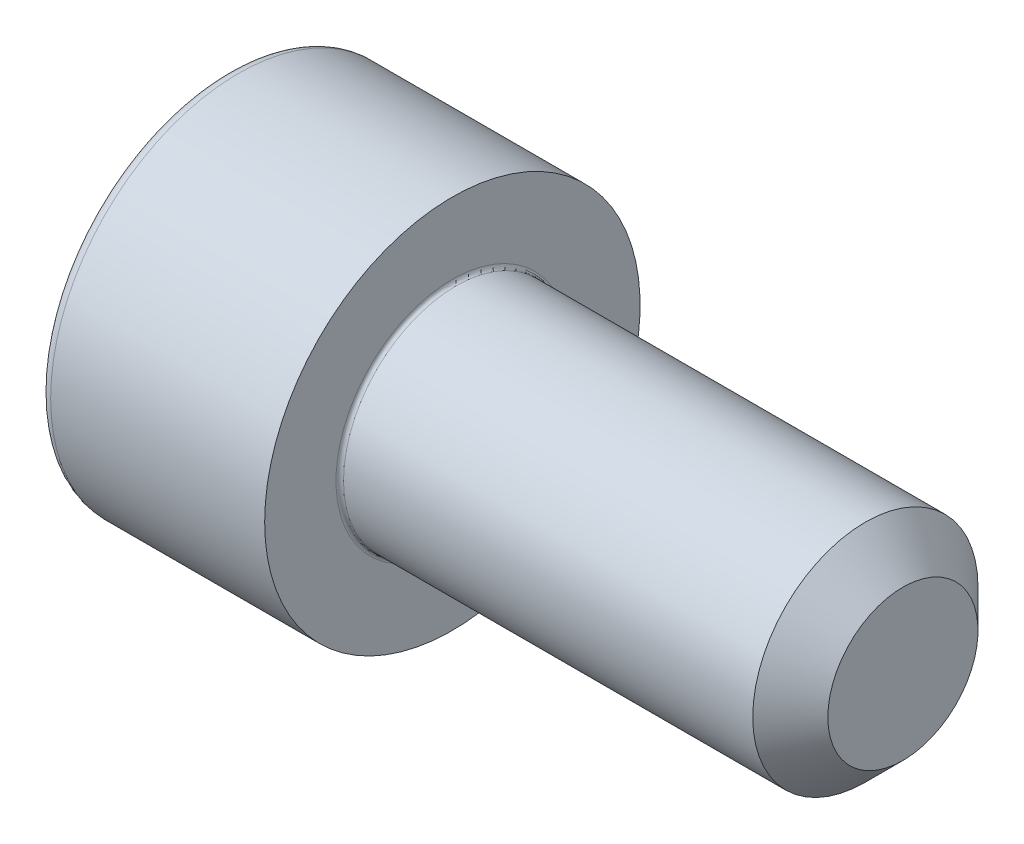
ISO-10303-21;
HEADER;
FILE_DESCRIPTION(('STEP AP214'),'2;1');
FILE_NAME('part.step','',(''),(''),'','','');
FILE_SCHEMA(('AUTOMOTIVE_DESIGN { 1 0 10303 214 1 1 1 1 }'));
ENDSEC;
DATA;
#1=APPLICATION_CONTEXT('core data for automotive mechanical design processes');
#2=APPLICATION_PROTOCOL_DEFINITION('international standard','automotive_design',2000,#1);
#3=PRODUCT_CONTEXT('',#1,'mechanical');
#4=PRODUCT('Part','Part','',(#3));
#5=PRODUCT_RELATED_PRODUCT_CATEGORY('part','',(#4));
#6=PRODUCT_DEFINITION_FORMATION('','',#4);
#7=PRODUCT_DEFINITION_CONTEXT('part definition',#1,'design');
#8=PRODUCT_DEFINITION('design','',#6,#7);
#9=PRODUCT_DEFINITION_SHAPE('','',#8);
#10=(LENGTH_UNIT() NAMED_UNIT(*) SI_UNIT(.MILLI.,.METRE.));
#11=(NAMED_UNIT(*) PLANE_ANGLE_UNIT() SI_UNIT($,.RADIAN.));
#12=(NAMED_UNIT(*) SI_UNIT($,.STERADIAN.) SOLID_ANGLE_UNIT());
#13=UNCERTAINTY_MEASURE_WITH_UNIT(LENGTH_MEASURE(1.E-05),#10,'distance_accuracy_value','');
#14=(GEOMETRIC_REPRESENTATION_CONTEXT(3) GLOBAL_UNCERTAINTY_ASSIGNED_CONTEXT((#13)) GLOBAL_UNIT_ASSIGNED_CONTEXT((#10,
#11,#12)) REPRESENTATION_CONTEXT('',''));
#15=CARTESIAN_POINT('',(0.,0.,0.));
#16=DIRECTION('',(0.,0.,1.));
#17=DIRECTION('',(1.,0.,0.));
#18=AXIS2_PLACEMENT_3D('',#15,#16,#17);
#19=CARTESIAN_POINT('',(0.,0.,0.));
#20=DIRECTION('',(-1.,0.,0.));
#21=DIRECTION('',(0.,0.,1.));
#22=AXIS2_PLACEMENT_3D('',#19,#20,#21);
#23=PLANE('',#22);
#24=DIRECTION('',(0.,-0.499999999999999,0.866025403784439));
#25=VECTOR('',#24,1.);
#26=CARTESIAN_POINT('',(0.,2.88675134594813,0.));
#27=LINE('',#26,#25);
#28=CARTESIAN_POINT('',(0.,2.88675134594813,0.));
#29=VERTEX_POINT('',#28);
#30=CARTESIAN_POINT('',(0.,1.44337567297406,2.5));
#31=VERTEX_POINT('',#30);
#32=EDGE_CURVE('E258',#29,#31,#27,.T.);
#33=ORIENTED_EDGE('',*,*,#32,.T.);
#34=DIRECTION('',(0.,1.,0.));
#35=VECTOR('',#34,1.);
#36=CARTESIAN_POINT('',(0.,-1.44337567297407,2.5));
#37=LINE('',#36,#35);
#38=CARTESIAN_POINT('',(0.,-1.44337567297407,2.5));
#39=VERTEX_POINT('',#38);
#40=EDGE_CURVE('E130',#39,#31,#37,.T.);
#41=ORIENTED_EDGE('',*,*,#40,.F.);
#42=DIRECTION('',(0.,-0.500000000000001,-0.866025403784438));
#43=VECTOR('',#42,1.);
#44=CARTESIAN_POINT('',(0.,-1.44337567297407,2.5));
#45=LINE('',#44,#43);
#46=CARTESIAN_POINT('',(0.,-2.88675134594814,0.));
#47=VERTEX_POINT('',#46);
#48=EDGE_CURVE('E261',#39,#47,#45,.T.);
#49=ORIENTED_EDGE('',*,*,#48,.T.);
#50=DIRECTION('',(0.,0.499999999999999,-0.866025403784439));
#51=VECTOR('',#50,1.);
#52=CARTESIAN_POINT('',(0.,-2.88675134594814,0.));
#53=LINE('',#52,#51);
#54=CARTESIAN_POINT('',(0.,-1.44337567297407,-2.5));
#55=VERTEX_POINT('',#54);
#56=EDGE_CURVE('E264',#47,#55,#53,.T.);
#57=ORIENTED_EDGE('',*,*,#56,.T.);
#58=DIRECTION('',(0.,-1.,0.));
#59=VECTOR('',#58,1.);
#60=CARTESIAN_POINT('',(0.,1.44337567297406,-2.5));
#61=LINE('',#60,#59);
#62=CARTESIAN_POINT('',(0.,1.44337567297406,-2.5));
#63=VERTEX_POINT('',#62);
#64=EDGE_CURVE('E267',#63,#55,#61,.T.);
#65=ORIENTED_EDGE('',*,*,#64,.F.);
#66=DIRECTION('',(0.,-0.500000000000001,-0.866025403784438));
#67=VECTOR('',#66,1.);
#68=CARTESIAN_POINT('',(0.,2.88675134594813,0.));
#69=LINE('',#68,#67);
#70=EDGE_CURVE('E125',#29,#63,#69,.T.);
#71=ORIENTED_EDGE('',*,*,#70,.F.);
#72=EDGE_LOOP('',(#33,#41,#49,#57,#65,#71));
#73=FACE_BOUND('',#72,.T.);
#74=CARTESIAN_POINT('',(0.,0.,0.));
#75=DIRECTION('',(-1.,0.,0.));
#76=DIRECTION('',(0.,0.,1.));
#77=AXIS2_PLACEMENT_3D('',#74,#75,#76);
#78=CIRCLE('',#77,4.7);
#79=CARTESIAN_POINT('',(0.,0.,4.7));
#80=VERTEX_POINT('',#79);
#81=EDGE_CURVE('E42',#80,#80,#78,.T.);
#82=ORIENTED_EDGE('',*,*,#81,.T.);
#83=EDGE_LOOP('',(#82));
#84=FACE_BOUND('',#83,.T.);
#85=ADVANCED_FACE('F34',(#73,#84),#23,.T.);
#86=CARTESIAN_POINT('',(-31.75,0.,0.));
#87=DIRECTION('',(-1.,0.,0.));
#88=DIRECTION('',(0.,0.,1.));
#89=AXIS2_PLACEMENT_3D('',#86,#87,#88);
#90=CYLINDRICAL_SURFACE('',#89,5.);
#91=CARTESIAN_POINT('',(0.300000000000002,0.,0.));
#92=DIRECTION('',(-1.,0.,0.));
#93=DIRECTION('',(0.,0.,1.));
#94=AXIS2_PLACEMENT_3D('',#91,#92,#93);
#95=CIRCLE('',#94,5.);
#96=CARTESIAN_POINT('',(0.300000000000002,0.,5.));
#97=VERTEX_POINT('',#96);
#98=EDGE_CURVE('E11',#97,#97,#95,.F.);
#99=ORIENTED_EDGE('',*,*,#98,.T.);
#100=EDGE_LOOP('',(#99));
#101=FACE_BOUND('',#100,.T.);
#102=CARTESIAN_POINT('',(6.,0.,0.));
#103=DIRECTION('',(-1.,0.,0.));
#104=DIRECTION('',(0.,0.,1.));
#105=AXIS2_PLACEMENT_3D('',#102,#103,#104);
#106=CIRCLE('',#105,5.);
#107=CARTESIAN_POINT('',(6.,0.,5.));
#108=VERTEX_POINT('',#107);
#109=EDGE_CURVE('E148',#108,#108,#106,.T.);
#110=ORIENTED_EDGE('',*,*,#109,.T.);
#111=EDGE_LOOP('',(#110));
#112=FACE_BOUND('',#111,.T.);
#113=ADVANCED_FACE('F172',(#101,#112),#90,.T.);
#114=CARTESIAN_POINT('',(6.,5.,0.));
#115=DIRECTION('',(1.,0.,0.));
#116=DIRECTION('',(0.,0.,-1.));
#117=AXIS2_PLACEMENT_3D('',#114,#115,#116);
#118=PLANE('',#117);
#119=CARTESIAN_POINT('',(6.,0.,0.));
#120=DIRECTION('',(1.,0.,0.));
#121=DIRECTION('',(0.,0.,-1.));
#122=AXIS2_PLACEMENT_3D('',#119,#120,#121);
#123=CIRCLE('',#122,3.09999999999999);
#124=CARTESIAN_POINT('',(6.,0.,-3.09999999999999));
#125=VERTEX_POINT('',#124);
#126=EDGE_CURVE('E151',#125,#125,#123,.F.);
#127=ORIENTED_EDGE('',*,*,#126,.T.);
#128=EDGE_LOOP('',(#127));
#129=FACE_BOUND('',#128,.T.);
#130=ORIENTED_EDGE('',*,*,#109,.F.);
#131=EDGE_LOOP('',(#130));
#132=FACE_BOUND('',#131,.T.);
#133=ADVANCED_FACE('F178',(#129,#132),#118,.T.);
#134=CARTESIAN_POINT('',(-31.75,0.,0.));
#135=DIRECTION('',(-1.,0.,0.));
#136=DIRECTION('',(0.,0.,1.));
#137=AXIS2_PLACEMENT_3D('',#134,#135,#136);
#138=CYLINDRICAL_SURFACE('',#137,2.99999999999999);
#139=CARTESIAN_POINT('',(6.1,0.,0.));
#140=DIRECTION('',(1.,0.,0.));
#141=DIRECTION('',(0.,0.,-1.));
#142=AXIS2_PLACEMENT_3D('',#139,#140,#141);
#143=CIRCLE('',#142,2.99999999999999);
#144=CARTESIAN_POINT('',(6.1,0.,-2.99999999999999));
#145=VERTEX_POINT('',#144);
#146=EDGE_CURVE('E154',#145,#145,#143,.T.);
#147=ORIENTED_EDGE('',*,*,#146,.T.);
#148=EDGE_LOOP('',(#147));
#149=FACE_BOUND('',#148,.T.);
#150=CARTESIAN_POINT('',(17.,0.,0.));
#151=DIRECTION('',(-1.,0.,0.));
#152=DIRECTION('',(0.,0.,1.));
#153=AXIS2_PLACEMENT_3D('',#150,#151,#152);
#154=CIRCLE('',#153,2.99999999999999);
#155=CARTESIAN_POINT('',(17.,0.,2.99999999999999));
#156=VERTEX_POINT('',#155);
#157=EDGE_CURVE('E145',#156,#156,#154,.T.);
#158=ORIENTED_EDGE('',*,*,#157,.T.);
#159=EDGE_LOOP('',(#158));
#160=FACE_BOUND('',#159,.T.);
#161=ADVANCED_FACE('F184',(#149,#160),#138,.T.);
#162=CARTESIAN_POINT('',(18.,0.,0.));
#163=DIRECTION('',(-1.,0.,0.));
#164=DIRECTION('',(0.,0.,1.));
#165=AXIS2_PLACEMENT_3D('',#162,#163,#164);
#166=CONICAL_SURFACE('',#165,2.,0.785398163397441);
#167=ORIENTED_EDGE('',*,*,#157,.F.);
#168=EDGE_LOOP('',(#167));
#169=FACE_BOUND('',#168,.T.);
#170=CARTESIAN_POINT('',(18.,0.,0.));
#171=DIRECTION('',(-1.,0.,0.));
#172=DIRECTION('',(0.,0.,1.));
#173=AXIS2_PLACEMENT_3D('',#170,#171,#172);
#174=CIRCLE('',#173,2.);
#175=CARTESIAN_POINT('',(18.,0.,2.));
#176=VERTEX_POINT('',#175);
#177=EDGE_CURVE('E141',#176,#176,#174,.T.);
#178=ORIENTED_EDGE('',*,*,#177,.T.);
#179=EDGE_LOOP('',(#178));
#180=FACE_BOUND('',#179,.T.);
#181=ADVANCED_FACE('F188',(#169,#180),#166,.T.);
#182=CARTESIAN_POINT('',(18.,2.,0.));
#183=DIRECTION('',(1.,0.,0.));
#184=DIRECTION('',(0.,0.,-1.));
#185=AXIS2_PLACEMENT_3D('',#182,#183,#184);
#186=PLANE('',#185);
#187=ORIENTED_EDGE('',*,*,#177,.F.);
#188=EDGE_LOOP('',(#187));
#189=FACE_BOUND('',#188,.T.);
#190=ADVANCED_FACE('F168',(#189),#186,.T.);
#191=CARTESIAN_POINT('',(6.1,0.,0.));
#192=DIRECTION('',(1.,0.,0.));
#193=DIRECTION('',(0.,0.,-1.));
#194=AXIS2_PLACEMENT_3D('',#191,#192,#193);
#195=TOROIDAL_SURFACE('',#194,3.09999999999999,0.1);
#196=ORIENTED_EDGE('',*,*,#146,.F.);
#197=EDGE_LOOP('',(#196));
#198=FACE_BOUND('',#197,.T.);
#199=ORIENTED_EDGE('',*,*,#126,.F.);
#200=EDGE_LOOP('',(#199));
#201=FACE_BOUND('',#200,.T.);
#202=ADVANCED_FACE('F161',(#198,#201),#195,.F.);
#203=CARTESIAN_POINT('',(0.300000000000002,0.,0.));
#204=DIRECTION('',(-1.,0.,0.));
#205=DIRECTION('',(0.,0.,1.));
#206=AXIS2_PLACEMENT_3D('',#203,#204,#205);
#207=TOROIDAL_SURFACE('',#206,4.7,0.3);
#208=ORIENTED_EDGE('',*,*,#98,.F.);
#209=EDGE_LOOP('',(#208));
#210=FACE_BOUND('',#209,.T.);
#211=ORIENTED_EDGE('',*,*,#81,.F.);
#212=EDGE_LOOP('',(#211));
#213=FACE_BOUND('',#212,.T.);
#214=ADVANCED_FACE('F36',(#210,#213),#207,.T.);
#215=CARTESIAN_POINT('',(1.3,2.88675134594813,0.));
#216=DIRECTION('',(0.,-0.866025403784439,-0.499999999999999));
#217=DIRECTION('',(0.,0.5,-0.866025403784439));
#218=AXIS2_PLACEMENT_3D('',#215,#216,#217);
#219=PLANE('',#218);
#220=ORIENTED_EDGE('',*,*,#32,.F.);
#221=DIRECTION('',(-1.,0.,0.));
#222=VECTOR('',#221,1.);
#223=CARTESIAN_POINT('',(1.3,2.88675134594813,0.));
#224=LINE('',#223,#222);
#225=CARTESIAN_POINT('',(1.3,2.88675134594813,0.));
#226=VERTEX_POINT('',#225);
#227=EDGE_CURVE('E248',#226,#29,#224,.T.);
#228=ORIENTED_EDGE('',*,*,#227,.F.);
#229=DIRECTION('',(0.,-0.499999999999999,0.866025403784439));
#230=VECTOR('',#229,1.);
#231=CARTESIAN_POINT('',(1.3,2.88675134594813,0.));
#232=LINE('',#231,#230);
#233=CARTESIAN_POINT('',(1.3,2.16506350946109,1.25));
#234=VERTEX_POINT('',#233);
#235=EDGE_CURVE('E117',#226,#234,#232,.T.);
#236=ORIENTED_EDGE('',*,*,#235,.T.);
#237=CARTESIAN_POINT('',(1.3,1.44337567297406,2.5));
#238=VERTEX_POINT('',#237);
#239=EDGE_CURVE('E108',#234,#238,#232,.T.);
#240=ORIENTED_EDGE('',*,*,#239,.T.);
#241=DIRECTION('',(-1.,0.,0.));
#242=VECTOR('',#241,1.);
#243=CARTESIAN_POINT('',(1.3,1.44337567297406,2.5));
#244=LINE('',#243,#242);
#245=EDGE_CURVE('E122',#238,#31,#244,.T.);
#246=ORIENTED_EDGE('',*,*,#245,.T.);
#247=EDGE_LOOP('',(#220,#228,#236,#240,#246));
#248=FACE_BOUND('',#247,.T.);
#249=ADVANCED_FACE('F121',(#248),#219,.T.);
#250=CARTESIAN_POINT('',(1.3,-1.44337567297407,2.5));
#251=DIRECTION('',(0.,0.,1.));
#252=DIRECTION('',(0.,-1.,0.));
#253=AXIS2_PLACEMENT_3D('',#250,#251,#252);
#254=PLANE('',#253);
#255=ORIENTED_EDGE('',*,*,#40,.T.);
#256=ORIENTED_EDGE('',*,*,#245,.F.);
#257=DIRECTION('',(0.,1.,0.));
#258=VECTOR('',#257,1.);
#259=CARTESIAN_POINT('',(1.3,-1.44337567297407,2.5));
#260=LINE('',#259,#258);
#261=CARTESIAN_POINT('',(1.3,0.,2.5));
#262=VERTEX_POINT('',#261);
#263=EDGE_CURVE('E105',#262,#238,#260,.T.);
#264=ORIENTED_EDGE('',*,*,#263,.F.);
#265=CARTESIAN_POINT('',(1.3,-1.44337567297407,2.5));
#266=VERTEX_POINT('',#265);
#267=EDGE_CURVE('E116',#266,#262,#260,.T.);
#268=ORIENTED_EDGE('',*,*,#267,.F.);
#269=DIRECTION('',(-1.,0.,0.));
#270=VECTOR('',#269,1.);
#271=CARTESIAN_POINT('',(1.3,-1.44337567297407,2.5));
#272=LINE('',#271,#270);
#273=EDGE_CURVE('E132',#266,#39,#272,.T.);
#274=ORIENTED_EDGE('',*,*,#273,.T.);
#275=EDGE_LOOP('',(#255,#256,#264,#268,#274));
#276=FACE_BOUND('',#275,.T.);
#277=ADVANCED_FACE('F127',(#276),#254,.F.);
#278=CARTESIAN_POINT('',(1.3,-1.44337567297407,2.5));
#279=DIRECTION('',(0.,0.866025403784438,-0.500000000000001));
#280=DIRECTION('',(0.,0.500000000000001,0.866025403784438));
#281=AXIS2_PLACEMENT_3D('',#278,#279,#280);
#282=PLANE('',#281);
#283=ORIENTED_EDGE('',*,*,#48,.F.);
#284=ORIENTED_EDGE('',*,*,#273,.F.);
#285=DIRECTION('',(0.,-0.500000000000001,-0.866025403784438));
#286=VECTOR('',#285,1.);
#287=CARTESIAN_POINT('',(1.3,-1.44337567297407,2.5));
#288=LINE('',#287,#286);
#289=CARTESIAN_POINT('',(1.3,-2.1650635094611,1.25000000000001));
#290=VERTEX_POINT('',#289);
#291=EDGE_CURVE('E287',#266,#290,#288,.T.);
#292=ORIENTED_EDGE('',*,*,#291,.T.);
#293=CARTESIAN_POINT('',(1.3,-2.88675134594814,0.));
#294=VERTEX_POINT('',#293);
#295=EDGE_CURVE('E276',#290,#294,#288,.T.);
#296=ORIENTED_EDGE('',*,*,#295,.T.);
#297=DIRECTION('',(-1.,0.,0.));
#298=VECTOR('',#297,1.);
#299=CARTESIAN_POINT('',(1.3,-2.88675134594814,0.));
#300=LINE('',#299,#298);
#301=EDGE_CURVE('E137',#294,#47,#300,.T.);
#302=ORIENTED_EDGE('',*,*,#301,.T.);
#303=EDGE_LOOP('',(#283,#284,#292,#296,#302));
#304=FACE_BOUND('',#303,.T.);
#305=ADVANCED_FACE('F202',(#304),#282,.T.);
#306=CARTESIAN_POINT('',(1.3,-2.88675134594814,0.));
#307=DIRECTION('',(0.,0.866025403784439,0.499999999999999));
#308=DIRECTION('',(0.,-0.5,0.866025403784439));
#309=AXIS2_PLACEMENT_3D('',#306,#307,#308);
#310=PLANE('',#309);
#311=ORIENTED_EDGE('',*,*,#56,.F.);
#312=ORIENTED_EDGE('',*,*,#301,.F.);
#313=DIRECTION('',(0.,0.499999999999999,-0.866025403784439));
#314=VECTOR('',#313,1.);
#315=CARTESIAN_POINT('',(1.3,-2.88675134594814,0.));
#316=LINE('',#315,#314);
#317=CARTESIAN_POINT('',(1.3,-2.1650635094611,-1.25));
#318=VERTEX_POINT('',#317);
#319=EDGE_CURVE('E254',#294,#318,#316,.T.);
#320=ORIENTED_EDGE('',*,*,#319,.T.);
#321=CARTESIAN_POINT('',(1.3,-1.44337567297407,-2.5));
#322=VERTEX_POINT('',#321);
#323=EDGE_CURVE('E286',#318,#322,#316,.T.);
#324=ORIENTED_EDGE('',*,*,#323,.T.);
#325=DIRECTION('',(-1.,0.,0.));
#326=VECTOR('',#325,1.);
#327=CARTESIAN_POINT('',(1.3,-1.44337567297407,-2.5));
#328=LINE('',#327,#326);
#329=EDGE_CURVE('E247',#322,#55,#328,.T.);
#330=ORIENTED_EDGE('',*,*,#329,.T.);
#331=EDGE_LOOP('',(#311,#312,#320,#324,#330));
#332=FACE_BOUND('',#331,.T.);
#333=ADVANCED_FACE('F205',(#332),#310,.T.);
#334=CARTESIAN_POINT('',(1.3,1.44337567297406,-2.5));
#335=DIRECTION('',(0.,0.,-1.));
#336=DIRECTION('',(0.,1.,0.));
#337=AXIS2_PLACEMENT_3D('',#334,#335,#336);
#338=PLANE('',#337);
#339=ORIENTED_EDGE('',*,*,#64,.T.);
#340=ORIENTED_EDGE('',*,*,#329,.F.);
#341=DIRECTION('',(0.,-1.,0.));
#342=VECTOR('',#341,1.);
#343=CARTESIAN_POINT('',(1.3,1.44337567297406,-2.5));
#344=LINE('',#343,#342);
#345=CARTESIAN_POINT('',(1.3,0.,-2.5));
#346=VERTEX_POINT('',#345);
#347=EDGE_CURVE('E251',#346,#322,#344,.T.);
#348=ORIENTED_EDGE('',*,*,#347,.F.);
#349=CARTESIAN_POINT('',(1.3,1.44337567297406,-2.5));
#350=VERTEX_POINT('',#349);
#351=EDGE_CURVE('E49',#350,#346,#344,.T.);
#352=ORIENTED_EDGE('',*,*,#351,.F.);
#353=DIRECTION('',(-1.,0.,0.));
#354=VECTOR('',#353,1.);
#355=CARTESIAN_POINT('',(1.3,1.44337567297406,-2.5));
#356=LINE('',#355,#354);
#357=EDGE_CURVE('E244',#350,#63,#356,.T.);
#358=ORIENTED_EDGE('',*,*,#357,.T.);
#359=EDGE_LOOP('',(#339,#340,#348,#352,#358));
#360=FACE_BOUND('',#359,.T.);
#361=ADVANCED_FACE('F209',(#360),#338,.F.);
#362=CARTESIAN_POINT('',(1.3,2.88675134594813,0.));
#363=DIRECTION('',(0.,0.866025403784438,-0.500000000000001));
#364=DIRECTION('',(0.,0.500000000000001,0.866025403784438));
#365=AXIS2_PLACEMENT_3D('',#362,#363,#364);
#366=PLANE('',#365);
#367=ORIENTED_EDGE('',*,*,#70,.T.);
#368=ORIENTED_EDGE('',*,*,#357,.F.);
#369=DIRECTION('',(0.,-0.500000000000001,-0.866025403784438));
#370=VECTOR('',#369,1.);
#371=CARTESIAN_POINT('',(1.3,2.88675134594813,0.));
#372=LINE('',#371,#370);
#373=CARTESIAN_POINT('',(1.3,2.16506350946109,-1.25));
#374=VERTEX_POINT('',#373);
#375=EDGE_CURVE('E234',#374,#350,#372,.T.);
#376=ORIENTED_EDGE('',*,*,#375,.F.);
#377=EDGE_CURVE('E240',#226,#374,#372,.T.);
#378=ORIENTED_EDGE('',*,*,#377,.F.);
#379=ORIENTED_EDGE('',*,*,#227,.T.);
#380=EDGE_LOOP('',(#367,#368,#376,#378,#379));
#381=FACE_BOUND('',#380,.T.);
#382=ADVANCED_FACE('F213',(#381),#366,.F.);
#383=CARTESIAN_POINT('',(1.3,2.88675134594813,0.));
#384=DIRECTION('',(1.,0.,0.));
#385=DIRECTION('',(0.,0.,-1.));
#386=AXIS2_PLACEMENT_3D('',#383,#384,#385);
#387=PLANE('',#386);
#388=ORIENTED_EDGE('',*,*,#347,.T.);
#389=ORIENTED_EDGE('',*,*,#323,.F.);
#390=CARTESIAN_POINT('',(1.3,0.,0.));
#391=DIRECTION('',(-1.,0.,0.));
#392=DIRECTION('',(0.,0.,1.));
#393=AXIS2_PLACEMENT_3D('',#390,#391,#392);
#394=CIRCLE('',#393,2.5);
#395=EDGE_CURVE('E282',#346,#318,#394,.T.);
#396=ORIENTED_EDGE('',*,*,#395,.F.);
#397=EDGE_LOOP('',(#388,#389,#396));
#398=FACE_BOUND('',#397,.T.);
#399=ADVANCED_FACE('F217',(#398),#387,.F.);
#400=ORIENTED_EDGE('',*,*,#319,.F.);
#401=ORIENTED_EDGE('',*,*,#295,.F.);
#402=EDGE_CURVE('E135',#318,#290,#394,.T.);
#403=ORIENTED_EDGE('',*,*,#402,.F.);
#404=EDGE_LOOP('',(#400,#401,#403));
#405=FACE_BOUND('',#404,.T.);
#406=ADVANCED_FACE('F220',(#405),#387,.F.);
#407=ORIENTED_EDGE('',*,*,#291,.F.);
#408=ORIENTED_EDGE('',*,*,#267,.T.);
#409=EDGE_CURVE('E131',#290,#262,#394,.T.);
#410=ORIENTED_EDGE('',*,*,#409,.F.);
#411=EDGE_LOOP('',(#407,#408,#410));
#412=FACE_BOUND('',#411,.T.);
#413=ADVANCED_FACE('F225',(#412),#387,.F.);
#414=ORIENTED_EDGE('',*,*,#263,.T.);
#415=ORIENTED_EDGE('',*,*,#239,.F.);
#416=EDGE_CURVE('E111',#262,#234,#394,.T.);
#417=ORIENTED_EDGE('',*,*,#416,.F.);
#418=EDGE_LOOP('',(#414,#415,#417));
#419=FACE_BOUND('',#418,.T.);
#420=ADVANCED_FACE('F107',(#419),#387,.F.);
#421=ORIENTED_EDGE('',*,*,#235,.F.);
#422=ORIENTED_EDGE('',*,*,#377,.T.);
#423=EDGE_CURVE('E142',#234,#374,#394,.T.);
#424=ORIENTED_EDGE('',*,*,#423,.F.);
#425=EDGE_LOOP('',(#421,#422,#424));
#426=FACE_BOUND('',#425,.T.);
#427=ADVANCED_FACE('F228',(#426),#387,.F.);
#428=ORIENTED_EDGE('',*,*,#375,.T.);
#429=ORIENTED_EDGE('',*,*,#351,.T.);
#430=EDGE_CURVE('E237',#374,#346,#394,.T.);
#431=ORIENTED_EDGE('',*,*,#430,.F.);
#432=EDGE_LOOP('',(#428,#429,#431));
#433=FACE_BOUND('',#432,.T.);
#434=ADVANCED_FACE('F198',(#433),#387,.F.);
#435=CARTESIAN_POINT('',(1.3,0.,0.));
#436=DIRECTION('',(-1.,0.,0.));
#437=DIRECTION('',(0.,0.,1.));
#438=AXIS2_PLACEMENT_3D('',#435,#436,#437);
#439=CONICAL_SURFACE('',#438,2.5,1.04719755119659);
#440=CARTESIAN_POINT('',(2.74337567297409,0.,0.));
#441=VERTEX_POINT('',#440);
#442=VERTEX_LOOP('',#441);
#443=FACE_BOUND('',#442,.T.);
#444=ORIENTED_EDGE('',*,*,#416,.T.);
#445=ORIENTED_EDGE('',*,*,#423,.T.);
#446=ORIENTED_EDGE('',*,*,#430,.T.);
#447=ORIENTED_EDGE('',*,*,#395,.T.);
#448=ORIENTED_EDGE('',*,*,#402,.T.);
#449=ORIENTED_EDGE('',*,*,#409,.T.);
#450=EDGE_LOOP('',(#444,#445,#446,#447,#448,#449));
#451=FACE_BOUND('',#450,.T.);
#452=ADVANCED_FACE('F196',(#443,#451),#439,.F.);
#453=CLOSED_SHELL('',(#85,#113,#133,#161,#181,#190,#202,#214,#249,#277,#305,#333,#361,#382,#399,
#406,#413,#420,#427,#434,#452));
#454=MANIFOLD_SOLID_BREP('B2',#453);
#455=ADVANCED_BREP_SHAPE_REPRESENTATION('',(#18,#454),#14);
#456=SHAPE_DEFINITION_REPRESENTATION(#9,#455);
ENDSEC;
END-ISO-10303-21;
